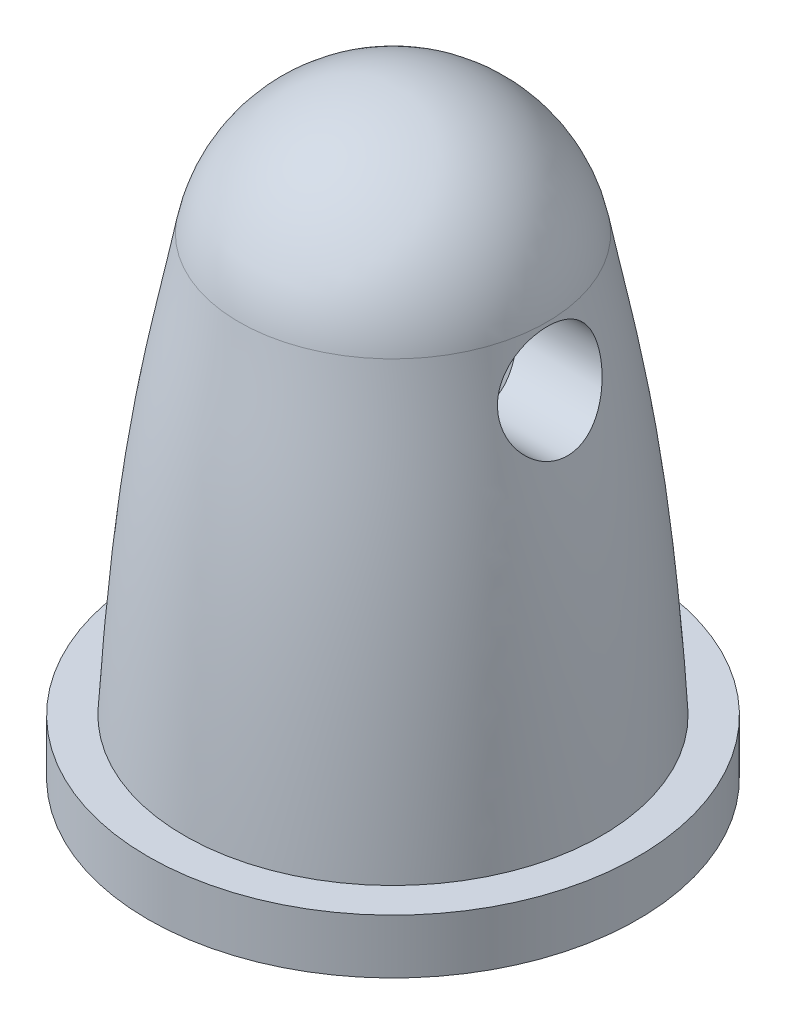
ISO-10303-21;
HEADER;
FILE_DESCRIPTION(('STEP AP214'),'2;1');
FILE_NAME('part.step','',(''),(''),'','','');
FILE_SCHEMA(('AUTOMOTIVE_DESIGN { 1 0 10303 214 1 1 1 1 }'));
ENDSEC;
DATA;
#1=APPLICATION_CONTEXT('core data for automotive mechanical design processes');
#2=APPLICATION_PROTOCOL_DEFINITION('international standard','automotive_design',2000,#1);
#3=PRODUCT_CONTEXT('',#1,'mechanical');
#4=PRODUCT('Part','Part','',(#3));
#5=PRODUCT_RELATED_PRODUCT_CATEGORY('part','',(#4));
#6=PRODUCT_DEFINITION_FORMATION('','',#4);
#7=PRODUCT_DEFINITION_CONTEXT('part definition',#1,'design');
#8=PRODUCT_DEFINITION('design','',#6,#7);
#9=PRODUCT_DEFINITION_SHAPE('','',#8);
#10=(LENGTH_UNIT() NAMED_UNIT(*) SI_UNIT(.MILLI.,.METRE.));
#11=(NAMED_UNIT(*) PLANE_ANGLE_UNIT() SI_UNIT($,.RADIAN.));
#12=(NAMED_UNIT(*) SI_UNIT($,.STERADIAN.) SOLID_ANGLE_UNIT());
#13=UNCERTAINTY_MEASURE_WITH_UNIT(LENGTH_MEASURE(1.E-05),#10,'distance_accuracy_value','');
#14=(GEOMETRIC_REPRESENTATION_CONTEXT(3) GLOBAL_UNCERTAINTY_ASSIGNED_CONTEXT((#13)) GLOBAL_UNIT_ASSIGNED_CONTEXT((#10,
#11,#12)) REPRESENTATION_CONTEXT('',''));
#15=CARTESIAN_POINT('',(0.,0.,0.));
#16=DIRECTION('',(0.,0.,1.));
#17=DIRECTION('',(1.,0.,0.));
#18=AXIS2_PLACEMENT_3D('',#15,#16,#17);
#19=CARTESIAN_POINT('',(0.,9.5,0.));
#20=DIRECTION('',(0.,-1.,0.));
#21=DIRECTION('',(0.,0.,-1.));
#22=AXIS2_PLACEMENT_3D('',#19,#20,#21);
#23=PLANE('',#22);
#24=DIRECTION('',(1.,0.,0.));
#25=VECTOR('',#24,1.);
#26=CARTESIAN_POINT('',(-6.75,9.5,-1.31638630698049));
#27=LINE('',#26,#25);
#28=CARTESIAN_POINT('',(-2.12535340374119,9.5,-1.31638630698049));
#29=VERTEX_POINT('',#28);
#30=CARTESIAN_POINT('',(2.12535340374119,9.5,-1.31638630698049));
#31=VERTEX_POINT('',#30);
#32=EDGE_CURVE('E11',#29,#31,#27,.T.);
#33=ORIENTED_EDGE('',*,*,#32,.F.);
#34=CARTESIAN_POINT('',(0.,9.5,0.));
#35=DIRECTION('',(0.,-1.,0.));
#36=DIRECTION('',(0.,0.,-1.));
#37=AXIS2_PLACEMENT_3D('',#34,#35,#36);
#38=CIRCLE('',#37,2.5);
#39=EDGE_CURVE('E82',#29,#31,#38,.T.);
#40=ORIENTED_EDGE('',*,*,#39,.T.);
#41=EDGE_LOOP('',(#33,#40));
#42=FACE_BOUND('',#41,.T.);
#43=ADVANCED_FACE('F45',(#42),#23,.T.);
#44=CARTESIAN_POINT('',(0.,10.6797448878994,0.));
#45=DIRECTION('',(0.,1.,0.));
#46=DIRECTION('',(-1.,0.,0.));
#47=AXIS2_PLACEMENT_3D('',#44,#45,#46);
#48=SPHERICAL_SURFACE('',#47,4.32025511210058);
#49=CARTESIAN_POINT('',(0.,11.5,0.));
#50=DIRECTION('',(0.,1.,0.));
#51=DIRECTION('',(-1.,0.,0.));
#52=AXIS2_PLACEMENT_3D('',#49,#50,#51);
#53=CIRCLE('',#52,4.24167252209598);
#54=CARTESIAN_POINT('',(-4.24167252209598,11.5,0.));
#55=VERTEX_POINT('',#54);
#56=EDGE_CURVE('E75',#55,#55,#53,.T.);
#57=ORIENTED_EDGE('',*,*,#56,.T.);
#58=EDGE_LOOP('',(#57));
#59=FACE_BOUND('',#58,.T.);
#60=ADVANCED_FACE('F47',(#59),#48,.T.);
#61=CARTESIAN_POINT('',(-4.24167252209598,11.5,0.));
#62=CARTESIAN_POINT('',(-4.80136333247777,8.49823023483901,0.));
#63=CARTESIAN_POINT('',(-5.38545505576879,6.49991136024788,0.));
#64=CARTESIAN_POINT('',(-5.75,0.,0.));
#65=B_SPLINE_CURVE_WITH_KNOTS('',3,(#61,#62,#63,#64),.UNSPECIFIED.,.F.,.F.,(4,4),(0.,1.),.UNSPECIFIED.);
#66=CARTESIAN_POINT('',(0.,15.,0.));
#67=DIRECTION('',(0.,1.,0.));
#68=AXIS1_PLACEMENT('',#66,#67);
#69=SURFACE_OF_REVOLUTION('',#65,#68);
#70=CARTESIAN_POINT('',(-4.25886427817733,11.408145201747,0.));
#71=CARTESIAN_POINT('',(-4.25886343094572,11.4081440183052,-0.078888091113546));
#72=CARTESIAN_POINT('',(-4.25789815285112,11.4014973248225,-0.157788256426419));
#73=CARTESIAN_POINT('',(-4.25426383047997,11.3751065416737,-0.313340820825009));
#74=CARTESIAN_POINT('',(-4.2515942627025,11.3553584276153,-0.389992521688006));
#75=CARTESIAN_POINT('',(-4.24521156157114,11.3033579587206,-0.53883405823016));
#76=CARTESIAN_POINT('',(-4.2414989911151,11.2711123451035,-0.611026275080978));
#77=CARTESIAN_POINT('',(-4.23402999180389,11.1950158228438,-0.749011774443779));
#78=CARTESIAN_POINT('',(-4.23027356063836,11.1511643002012,-0.814804718156197));
#79=CARTESIAN_POINT('',(-4.22392103216107,11.0527563081014,-0.93854230787793));
#80=CARTESIAN_POINT('',(-4.22133189947932,10.998138308273,-0.996438445311252));
#81=CARTESIAN_POINT('',(-4.21865645536383,10.8799039104991,-1.10223948672139));
#82=CARTESIAN_POINT('',(-4.21856967496478,10.8162892008709,-1.1501462611318));
#83=CARTESIAN_POINT('',(-4.22203068488312,10.6831159349492,-1.23381635021332));
#84=CARTESIAN_POINT('',(-4.22551642586192,10.6136774491246,-1.26977308847379));
#85=CARTESIAN_POINT('',(-4.23677394938012,10.4701198516393,-1.3296258898986));
#86=CARTESIAN_POINT('',(-4.2445447227832,10.3960018456555,-1.3535247901786));
#87=CARTESIAN_POINT('',(-4.26430454981433,10.2475707761797,-1.38824662851638));
#88=CARTESIAN_POINT('',(-4.27616820478513,10.1733224027355,-1.39941996692651));
#89=CARTESIAN_POINT('',(-4.30383906394308,10.0247325936802,-1.4098977182161));
#90=CARTESIAN_POINT('',(-4.31964686397006,9.95039114569827,-1.40920033672144));
#91=CARTESIAN_POINT('',(-4.35491357348206,9.80173395361379,-1.39616112150961));
#92=CARTESIAN_POINT('',(-4.37445121040864,9.72746190367057,-1.3835393949153));
#93=CARTESIAN_POINT('',(-4.41587606749609,9.58247192739896,-1.3469001892255));
#94=CARTESIAN_POINT('',(-4.43776409809327,9.5117552394103,-1.32287876959053));
#95=CARTESIAN_POINT('',(-4.48432344043321,9.37039257992908,-1.26206347950905));
#96=CARTESIAN_POINT('',(-4.50908177032456,9.30011577409774,-1.22447681497062));
#97=CARTESIAN_POINT('',(-4.55846407607436,9.16669874487185,-1.13790206116197));
#98=CARTESIAN_POINT('',(-4.58308765537622,9.10357398092935,-1.08888994856308));
#99=CARTESIAN_POINT('',(-4.63154882247806,8.98378081696766,-0.9783038245003));
#100=CARTESIAN_POINT('',(-4.65531472955389,8.92747518853438,-0.916303123971936));
#101=CARTESIAN_POINT('',(-4.69913551755729,8.82636865421289,-0.782600707035401));
#102=CARTESIAN_POINT('',(-4.71919942625347,8.78153965478301,-0.710923348574198));
#103=CARTESIAN_POINT('',(-4.7531489105451,8.70695952771298,-0.563389416173418));
#104=CARTESIAN_POINT('',(-4.76729117651366,8.6765718255496,-0.487915406687652));
#105=CARTESIAN_POINT('',(-4.78955049601213,8.62914834515324,-0.332052798669344));
#106=CARTESIAN_POINT('',(-4.79767222916391,8.61210219626071,-0.251668069845307));
#107=CARTESIAN_POINT('',(-4.80669991505807,8.5931835094767,-0.0963556808167835));
#108=CARTESIAN_POINT('',(-4.80820598606381,8.59004873998288,-0.0216145898445552));
#109=CARTESIAN_POINT('',(-4.80552767976854,8.59564489200729,0.127308986655985));
#110=CARTESIAN_POINT('',(-4.80134457726857,8.60437315531723,0.201491593581661));
#111=CARTESIAN_POINT('',(-4.78789418460293,8.63271412971894,0.344230690789051));
#112=CARTESIAN_POINT('',(-4.77882983845297,8.65189270939941,0.412893810910246));
#113=CARTESIAN_POINT('',(-4.75639299162758,8.70006011801455,0.54592724088857));
#114=CARTESIAN_POINT('',(-4.74301979191679,8.72905053878558,0.610296852153137));
#115=CARTESIAN_POINT('',(-4.71210703771184,8.7974194962702,0.73623642555089));
#116=CARTESIAN_POINT('',(-4.69440254866772,8.83721869917912,0.797536674171018));
#117=CARTESIAN_POINT('',(-4.65626343539911,8.92536384884396,0.912859426842273));
#118=CARTESIAN_POINT('',(-4.63582323471298,8.97372731980152,0.966866600621305));
#119=CARTESIAN_POINT('',(-4.59146692389878,9.08246883678465,1.07106374917265));
#120=CARTESIAN_POINT('',(-4.56740355529576,9.143536576022,1.1204722038265));
#121=CARTESIAN_POINT('',(-4.51894503769046,9.27280387631594,1.20837173202032));
#122=CARTESIAN_POINT('',(-4.49455040243712,9.34099329486206,1.24687804953228));
#123=CARTESIAN_POINT('',(-4.44545994880295,9.48725990649342,1.31408293702041));
#124=CARTESIAN_POINT('',(-4.42082839068509,9.56568093799604,1.34208501340873));
#125=CARTESIAN_POINT('',(-4.37443482289286,9.72703284384123,1.38394467179998));
#126=CARTESIAN_POINT('',(-4.3526721596135,9.80996268486366,1.39780548039876));
#127=CARTESIAN_POINT('',(-4.31406996475206,9.97534891162703,1.41029133494967));
#128=CARTESIAN_POINT('',(-4.29709710016275,10.0577381266962,1.40938194103589));
#129=CARTESIAN_POINT('',(-4.26810383892541,10.2219268056223,1.39298833671689));
#130=CARTESIAN_POINT('',(-4.25608056014036,10.3037265853628,1.3775126255623));
#131=CARTESIAN_POINT('',(-4.23793118888034,10.4579151035015,1.33383956693536));
#132=CARTESIAN_POINT('',(-4.23143472011712,10.5305524384204,1.30666772392248));
#133=CARTESIAN_POINT('',(-4.22252122515259,10.6705739736958,1.24064202936199));
#134=CARTESIAN_POINT('',(-4.22010395421338,10.7379584889721,1.20178887881758));
#135=CARTESIAN_POINT('',(-4.21851832120336,10.8640405236535,1.11447826588493));
#136=CARTESIAN_POINT('',(-4.21928047309719,10.9228950454862,1.06624795434058));
#137=CARTESIAN_POINT('',(-4.22283002346697,11.032053706852,0.960983412108358));
#138=CARTESIAN_POINT('',(-4.22561781391796,11.0823561891812,0.903947479154507));
#139=CARTESIAN_POINT('',(-4.23217041816304,11.1744655129066,0.780763917332841));
#140=CARTESIAN_POINT('',(-4.23596173658184,11.2159764246743,0.714396362198823));
#141=CARTESIAN_POINT('',(-4.24331738776044,11.2874451043816,0.575709170475818));
#142=CARTESIAN_POINT('',(-4.24688176787961,11.317405289465,0.503390783025853));
#143=CARTESIAN_POINT('',(-4.25265606651954,11.3633155102262,0.359891547476675));
#144=CARTESIAN_POINT('',(-4.25494244979247,11.3800893414867,0.288976280441787));
#145=CARTESIAN_POINT('',(-4.25804691646332,11.4025045087516,0.145377378972957));
#146=CARTESIAN_POINT('',(-4.25886505888449,11.4081462922651,0.0726938157435614));
#147=CARTESIAN_POINT('',(-4.25886427817733,11.408145201747,0.));
#148=B_SPLINE_CURVE_WITH_KNOTS('',3,(#70,#71,#72,#73,#74,#75,#76,#77,#78,#79,#80,#81,#82,#83,
#84,#85,#86,#87,#88,#89,#90,#91,#92,#93,#94,#95,#96,#97,#98,#99,#100,#101,#102,#103,#104,#105,
#106,#107,#108,#109,#110,#111,#112,#113,#114,#115,#116,#117,#118,#119,#120,#121,#122,#123,#124,
#125,#126,#127,#128,#129,#130,#131,#132,#133,#134,#135,#136,#137,#138,#139,#140,#141,#142,#143,
#144,#145,#146,#147),.UNSPECIFIED.,.T.,.F.,(4,2,2,2,2,2,2,2,2,2,2,2,2,2,2,2,2,2,2,2,2,2,2,2,2,2,
2,2,2,2,2,2,2,2,2,2,2,2,4),(0.,0.236403135422363,0.472878920962367,0.709227327308627,
0.94558823995024,1.18334130759919,1.4210498177074,1.65469851605233,1.88829221300473,
2.11528534934249,2.34231279819251,2.57480509006313,2.80737780630243,3.05663847575646,
3.30642804871933,3.56628543584055,3.82550050320521,4.0718829111488,4.31807361032084,
4.54139896764379,4.76467429160116,4.97931212374379,5.19398479462989,5.41864821178372,
5.64377676201735,5.88917542933656,6.13422925267383,6.39346372248577,6.65263902984713,
6.90366137633731,7.15453734539514,7.38685921578238,7.61916714715798,7.84642490912266,
8.07372665874698,8.30776417880335,8.54175269676261,8.75960226831249,8.97744308211617),.UNSPECIFIED.);
#149=CARTESIAN_POINT('',(-4.25886427817733,11.408145201747,0.));
#150=VERTEX_POINT('',#149);
#151=EDGE_CURVE('E98',#150,#150,#148,.T.);
#152=ORIENTED_EDGE('',*,*,#151,.F.);
#153=EDGE_LOOP('',(#152));
#154=FACE_BOUND('',#153,.T.);
#155=CARTESIAN_POINT('',(4.30959021666946,10.,-1.40814520174794));
#156=CARTESIAN_POINT('',(4.29394533595754,10.0747547282883,-1.40814655122251));
#157=CARTESIAN_POINT('',(4.28017061477872,10.1498940415387,-1.40217887601156));
#158=CARTESIAN_POINT('',(4.25686528976545,10.298874391215,-1.37812659926051));
#159=CARTESIAN_POINT('',(4.24733292852597,10.3727159530378,-1.36004702288713));
#160=CARTESIAN_POINT('',(4.23253176315989,10.5169469417864,-1.31202924369884));
#161=CARTESIAN_POINT('',(4.22726603949379,10.5873338401053,-1.28208249611715));
#162=CARTESIAN_POINT('',(4.22051772809078,10.7224725480389,-1.21108794791209));
#163=CARTESIAN_POINT('',(4.21903591465473,10.7872232016921,-1.17003787711802));
#164=CARTESIAN_POINT('',(4.21895501506865,10.9088907096803,-1.07822575742675));
#165=CARTESIAN_POINT('',(4.22034125180192,10.9658458666205,-1.02751435590552));
#166=CARTESIAN_POINT('',(4.22485644952711,11.0708065573518,-0.917617655373518));
#167=CARTESIAN_POINT('',(4.22798564660529,11.1188108775645,-0.858431209213937));
#168=CARTESIAN_POINT('',(4.23494757436766,11.2059810163499,-0.731172444847959));
#169=CARTESIAN_POINT('',(4.2387991283157,11.244826224844,-0.662881329062196));
#170=CARTESIAN_POINT('',(4.2460116977825,11.3106483371718,-0.520774617465761));
#171=CARTESIAN_POINT('',(4.24937269573995,11.3376248161888,-0.446958824021275));
#172=CARTESIAN_POINT('',(4.25477968628808,11.3791850575091,-0.294955261348377));
#173=CARTESIAN_POINT('',(4.25681024412399,11.3936239724998,-0.216727231369361));
#174=CARTESIAN_POINT('',(4.25899904616218,11.4091429827059,-0.0589338498302333));
#175=CARTESIAN_POINT('',(4.25915740587812,11.410223902103,0.0206314189195891));
#176=CARTESIAN_POINT('',(4.25757261603481,11.3990510644295,0.178030010538543));
#177=CARTESIAN_POINT('',(4.25584766680694,11.3869249431792,0.255872623061046));
#178=CARTESIAN_POINT('',(4.25093542321119,11.3499012871602,0.40841182042891));
#179=CARTESIAN_POINT('',(4.24774803049557,11.3250028934568,0.483108193324178));
#180=CARTESIAN_POINT('',(4.24069982882114,11.2630395001671,0.627534989508571));
#181=CARTESIAN_POINT('',(4.23683677759947,11.2259336153345,0.697247753291845));
#182=CARTESIAN_POINT('',(4.22954945866913,11.14059292707,0.829527855945051));
#183=CARTESIAN_POINT('',(4.2261252278036,11.0923571901324,0.892094594790494));
#184=CARTESIAN_POINT('',(4.22096575567688,10.9857242326414,1.00871299024146));
#185=CARTESIAN_POINT('',(4.21924148265117,10.9272638527415,1.06270748841572));
#186=CARTESIAN_POINT('',(4.21879744200447,10.8020863340728,1.16009245083609));
#187=CARTESIAN_POINT('',(4.22007691014986,10.7353712996042,1.20348560925055));
#188=CARTESIAN_POINT('',(4.22659429651548,10.597386177356,1.27749254484313));
#189=CARTESIAN_POINT('',(4.23173852833478,10.5262598929639,1.30838255664621));
#190=CARTESIAN_POINT('',(4.2464077078922,10.3803240271173,1.35800024277714));
#191=CARTESIAN_POINT('',(4.25593195113554,10.3055150397276,1.37672987185109));
#192=CARTESIAN_POINT('',(4.27908758248901,10.1562051543301,1.40145457440324));
#193=CARTESIAN_POINT('',(4.29262344911186,10.081734052483,1.40772220161514));
#194=CARTESIAN_POINT('',(4.32338182802691,9.93350234578669,1.40852698664764));
#195=CARTESIAN_POINT('',(4.34060509531433,9.85974188967905,1.40306174009068));
#196=CARTESIAN_POINT('',(4.37859325292224,9.71201468325025,1.38048035948972));
#197=CARTESIAN_POINT('',(4.39946530712775,9.63814059083785,1.36294209904237));
#198=CARTESIAN_POINT('',(4.44316695306358,9.494526538776,1.31646555388645));
#199=CARTESIAN_POINT('',(4.46600058297534,9.4247956327104,1.28750328895727));
#200=CARTESIAN_POINT('',(4.51404527028311,9.28605802006976,1.21641841870768));
#201=CARTESIAN_POINT('',(4.53930740934933,9.21748466091213,1.17348222771139));
#202=CARTESIAN_POINT('',(4.58893860733346,9.08859697758857,1.07643604590603));
#203=CARTESIAN_POINT('',(4.61330914210194,9.02826850650289,1.02234560464798));
#204=CARTESIAN_POINT('',(4.66015065891979,8.91597331476703,0.902583931917324));
#205=CARTESIAN_POINT('',(4.68256061051977,8.86424716789689,0.836661834599392));
#206=CARTESIAN_POINT('',(4.72304957651572,8.77286039991646,0.695732044444105));
#207=CARTESIAN_POINT('',(4.74113078653783,8.73319365926164,0.620728986848869));
#208=CARTESIAN_POINT('',(4.77037894108641,8.66988425709338,0.469004603790351));
#209=CARTESIAN_POINT('',(4.78192585147228,8.64535110824444,0.392729554409024));
#210=CARTESIAN_POINT('',(4.79887079221998,8.60954730927926,0.23648340997358));
#211=CARTESIAN_POINT('',(4.80427314056833,8.59826734552823,0.15651495157445));
#212=CARTESIAN_POINT('',(4.80825554530345,8.58994462811659,0.00282626159214297));
#213=CARTESIAN_POINT('',(4.80739875856019,8.59172668864278,-0.0708183111921897));
#214=CARTESIAN_POINT('',(4.80025048316134,8.60669378229353,-0.216660000498097));
#215=CARTESIAN_POINT('',(4.79395963798362,8.61987746528713,-0.288857287365353));
#216=CARTESIAN_POINT('',(4.77660746669996,8.65667199861181,-0.428297430573682));
#217=CARTESIAN_POINT('',(4.76564722493998,8.68006214308186,-0.495611766717179));
#218=CARTESIAN_POINT('',(4.73972036847765,8.73633105650029,-0.625310861612371));
#219=CARTESIAN_POINT('',(4.72475288692327,8.76921187860638,-0.687694549972725));
#220=CARTESIAN_POINT('',(4.69071405978572,8.84569371423853,-0.809915192681984));
#221=CARTESIAN_POINT('',(4.67144772142612,8.88982734414837,-0.86936309795218));
#222=CARTESIAN_POINT('',(4.63059473865386,8.98638863375155,-0.980240390608341));
#223=CARTESIAN_POINT('',(4.60900677683537,9.03882101061613,-1.0316651842859));
#224=CARTESIAN_POINT('',(4.57481571597136,9.12523819013465,-1.1041977116761));
#225=CARTESIAN_POINT('',(4.56258825248311,9.15677692657139,-1.12846198685866));
#226=CARTESIAN_POINT('',(4.53801233243494,9.22172393221763,-1.17419564572205));
#227=CARTESIAN_POINT('',(4.52566400245885,9.25513038881428,-1.19566767417972));
#228=CARTESIAN_POINT('',(4.4886895188324,9.35797238538375,-1.25577670555464));
#229=CARTESIAN_POINT('',(4.46413677362455,9.4300233581528,-1.29010063042281));
#230=CARTESIAN_POINT('',(4.41566208179063,9.58294277501937,-1.34756323571145));
#231=CARTESIAN_POINT('',(4.39182595131985,9.66406778552186,-1.37009095225531));
#232=CARTESIAN_POINT('',(4.3477138647596,9.82996346003225,-1.4003760258463));
#233=CARTESIAN_POINT('',(4.32743543986382,9.91473154473319,-1.40814366247924));
#234=CARTESIAN_POINT('',(4.30959021666946,10.,-1.40814520174794));
#235=B_SPLINE_CURVE_WITH_KNOTS('',3,(#155,#156,#157,#158,#159,#160,#161,#162,#163,#164,#165,
#166,#167,#168,#169,#170,#171,#172,#173,#174,#175,#176,#177,#178,#179,#180,#181,#182,#183,#184,
#185,#186,#187,#188,#189,#190,#191,#192,#193,#194,#195,#196,#197,#198,#199,#200,#201,#202,#203,
#204,#205,#206,#207,#208,#209,#210,#211,#212,#213,#214,#215,#216,#217,#218,#219,#220,#221,#222,
#223,#224,#225,#226,#227,#228,#229,#230,#231,#232,#233,#234),.UNSPECIFIED.,.T.,.F.,(4,2,2,2,2,2,
2,2,2,2,2,2,2,2,2,2,2,2,2,2,2,2,2,2,2,2,2,2,2,2,2,2,2,2,2,2,2,2,2,4),(0.,0.228836528065193,
0.457578171760343,0.686484817355405,0.915438300322957,1.14322302274748,1.37103860641503,
1.60592581148882,1.84082142318201,2.07839600920387,2.31595593691922,2.55124023996314,
2.78654036794003,3.02263672360362,3.25875288882738,3.49638271086589,3.73395207995393,
3.96594115599157,4.19789293122236,4.42471335521936,4.65158026518437,4.88681150843719,
5.12253917791318,5.37566603776419,5.62835296778285,5.88721953337158,6.14595451703702,
6.38747634618718,6.62882834490884,6.84875086982495,7.06864735602945,7.28400772919665,
7.49941472713162,7.72799478511977,7.95670524224819,8.08147055853795,8.20611682449206,
8.45543847804852,8.71664123513238,8.9776620120587),.UNSPECIFIED.);
#236=CARTESIAN_POINT('',(4.30959021666946,10.,-1.40814520174794));
#237=VERTEX_POINT('',#236);
#238=EDGE_CURVE('E84',#237,#237,#235,.T.);
#239=ORIENTED_EDGE('',*,*,#238,.F.);
#240=EDGE_LOOP('',(#239));
#241=FACE_BOUND('',#240,.T.);
#242=CARTESIAN_POINT('',(0.,0.,0.));
#243=DIRECTION('',(0.,1.,0.));
#244=DIRECTION('',(-1.,0.,0.));
#245=AXIS2_PLACEMENT_3D('',#242,#243,#244);
#246=CIRCLE('',#245,5.75);
#247=CARTESIAN_POINT('',(-5.75,0.,0.));
#248=VERTEX_POINT('',#247);
#249=EDGE_CURVE('E109',#248,#248,#246,.T.);
#250=ORIENTED_EDGE('',*,*,#249,.T.);
#251=EDGE_LOOP('',(#250));
#252=FACE_BOUND('',#251,.T.);
#253=ORIENTED_EDGE('',*,*,#56,.F.);
#254=EDGE_LOOP('',(#253));
#255=FACE_BOUND('',#254,.T.);
#256=ADVANCED_FACE('F119',(#154,#241,#252,#255),#69,.F.);
#257=CARTESIAN_POINT('',(0.,-1.5,0.));
#258=DIRECTION('',(0.,1.,0.));
#259=DIRECTION('',(0.,0.,1.));
#260=AXIS2_PLACEMENT_3D('',#257,#258,#259);
#261=CYLINDRICAL_SURFACE('',#260,6.75);
#262=CARTESIAN_POINT('',(0.,-1.5,0.));
#263=DIRECTION('',(0.,-1.,0.));
#264=DIRECTION('',(0.,0.,-1.));
#265=AXIS2_PLACEMENT_3D('',#262,#263,#264);
#266=CIRCLE('',#265,6.75);
#267=CARTESIAN_POINT('',(0.,-1.5,-6.75));
#268=VERTEX_POINT('',#267);
#269=EDGE_CURVE('E93',#268,#268,#266,.T.);
#270=ORIENTED_EDGE('',*,*,#269,.F.);
#271=EDGE_LOOP('',(#270));
#272=FACE_BOUND('',#271,.T.);
#273=CARTESIAN_POINT('',(0.,0.,0.));
#274=DIRECTION('',(0.,-1.,0.));
#275=DIRECTION('',(0.,0.,-1.));
#276=AXIS2_PLACEMENT_3D('',#273,#274,#275);
#277=CIRCLE('',#276,6.75);
#278=CARTESIAN_POINT('',(0.,0.,-6.75));
#279=VERTEX_POINT('',#278);
#280=EDGE_CURVE('E88',#279,#279,#277,.T.);
#281=ORIENTED_EDGE('',*,*,#280,.T.);
#282=EDGE_LOOP('',(#281));
#283=FACE_BOUND('',#282,.T.);
#284=ADVANCED_FACE('F123',(#272,#283),#261,.T.);
#285=CARTESIAN_POINT('',(0.,-1.5,0.));
#286=DIRECTION('',(0.,-1.,0.));
#287=DIRECTION('',(0.,0.,-1.));
#288=AXIS2_PLACEMENT_3D('',#285,#286,#287);
#289=PLANE('',#288);
#290=CARTESIAN_POINT('',(0.,-1.5,0.));
#291=DIRECTION('',(0.,-1.,0.));
#292=DIRECTION('',(0.,0.,-1.));
#293=AXIS2_PLACEMENT_3D('',#290,#291,#292);
#294=CIRCLE('',#293,2.5);
#295=CARTESIAN_POINT('',(0.,-1.5,-2.5));
#296=VERTEX_POINT('',#295);
#297=EDGE_CURVE('E95',#296,#296,#294,.T.);
#298=ORIENTED_EDGE('',*,*,#297,.F.);
#299=EDGE_LOOP('',(#298));
#300=FACE_BOUND('',#299,.T.);
#301=ORIENTED_EDGE('',*,*,#269,.T.);
#302=EDGE_LOOP('',(#301));
#303=FACE_BOUND('',#302,.T.);
#304=ADVANCED_FACE('F154',(#300,#303),#289,.T.);
#305=CARTESIAN_POINT('',(0.,0.,0.));
#306=DIRECTION('',(0.,-1.,0.));
#307=DIRECTION('',(0.,0.,-1.));
#308=AXIS2_PLACEMENT_3D('',#305,#306,#307);
#309=PLANE('',#308);
#310=ORIENTED_EDGE('',*,*,#249,.F.);
#311=EDGE_LOOP('',(#310));
#312=FACE_BOUND('',#311,.T.);
#313=ORIENTED_EDGE('',*,*,#280,.F.);
#314=EDGE_LOOP('',(#313));
#315=FACE_BOUND('',#314,.T.);
#316=ADVANCED_FACE('F153',(#312,#315),#309,.F.);
#317=CARTESIAN_POINT('',(0.,9.5,0.));
#318=DIRECTION('',(0.,-1.,0.));
#319=DIRECTION('',(0.,0.,-1.));
#320=AXIS2_PLACEMENT_3D('',#317,#318,#319);
#321=CYLINDRICAL_SURFACE('',#320,2.5);
#322=ORIENTED_EDGE('',*,*,#39,.F.);
#323=CARTESIAN_POINT('',(-2.12535340374119,9.5,-1.31638630698049));
#324=CARTESIAN_POINT('',(-2.14343467257802,9.42324119398876,-1.28720455820582));
#325=CARTESIAN_POINT('',(-2.16461341814112,9.34985435625439,-1.25167655363524));
#326=CARTESIAN_POINT('',(-2.21027513431036,9.2109995585131,-1.16913945975044));
#327=CARTESIAN_POINT('',(-2.23475673804233,9.14552834379951,-1.12213511339109));
#328=CARTESIAN_POINT('',(-2.28410307007731,9.02373802259465,-1.01793638731284));
#329=CARTESIAN_POINT('',(-2.3089669215283,8.96740063985899,-0.960762848822927));
#330=CARTESIAN_POINT('',(-2.35660919967841,8.86486040447523,-0.837124648988969));
#331=CARTESIAN_POINT('',(-2.37938711505441,8.81866003284722,-0.770657719602357));
#332=CARTESIAN_POINT('',(-2.42083151855011,8.73724690885494,-0.628592865949672));
#333=CARTESIAN_POINT('',(-2.43942821789806,8.70221708316626,-0.552868516608759));
#334=CARTESIAN_POINT('',(-2.46986064282525,8.64587629428458,-0.395225863814871));
#335=CARTESIAN_POINT('',(-2.48170473286181,8.62454835439119,-0.313315366274572));
#336=CARTESIAN_POINT('',(-2.49621628927092,8.59854829057585,-0.156150545115297));
#337=CARTESIAN_POINT('',(-2.49980416822165,8.59220321902047,-0.0812562726208634));
#338=CARTESIAN_POINT('',(-2.50017980140861,8.59153483790509,0.0685949484622098));
#339=CARTESIAN_POINT('',(-2.49696978927166,8.59720757957509,0.143551868376895));
#340=CARTESIAN_POINT('',(-2.48458982446274,8.61937204574076,0.285508164235501));
#341=CARTESIAN_POINT('',(-2.47588378466432,8.63502250084408,0.352683302043978));
#342=CARTESIAN_POINT('',(-2.45373234616771,8.67562686495875,0.483310001417672));
#343=CARTESIAN_POINT('',(-2.44028677519515,8.70058111214993,0.546761427534129));
#344=CARTESIAN_POINT('',(-2.40889035486465,8.76051905221149,0.672046763317179));
#345=CARTESIAN_POINT('',(-2.39073221925529,8.79597928431716,0.733599289184392));
#346=CARTESIAN_POINT('',(-2.35179827661177,8.87526844490848,0.850195051421396));
#347=CARTESIAN_POINT('',(-2.33101950696092,8.91910687428169,0.905230781865649));
#348=CARTESIAN_POINT('',(-2.2858194765306,9.02013531073051,1.01436420221788));
#349=CARTESIAN_POINT('',(-2.26126600028163,9.07830678650654,1.06749974105491));
#350=CARTESIAN_POINT('',(-2.21340929456927,9.20291147427089,1.1634823319562));
#351=CARTESIAN_POINT('',(-2.19010378668262,9.26932884059384,1.20634866703467));
#352=CARTESIAN_POINT('',(-2.15303868058163,9.39101209332493,1.27099592119699));
#353=CARTESIAN_POINT('',(-2.13837687783461,9.44464904347371,1.29535919392709));
#354=CARTESIAN_POINT('',(-2.12535340374119,9.5,1.31638630698049));
#355=B_SPLINE_CURVE_WITH_KNOTS('',3,(#323,#324,#325,#326,#327,#328,#329,#330,#331,#332,#333,
#334,#335,#336,#337,#338,#339,#340,#341,#342,#343,#344,#345,#346,#347,#348,#349,#350,#351,#352,
#353,#354),.UNSPECIFIED.,.F.,.F.,(4,2,2,2,2,2,2,2,2,2,2,2,2,2,2,4),(0.,0.25161017195686,
0.503116533686961,0.754113263966221,1.00517135700858,1.26015154078853,1.5148151905215,
1.73932916505095,1.96376938102514,2.17141627013214,2.37907070764934,2.59815772419482,
2.81749467593707,3.06402346442695,3.31008563948528,3.49176835585453),.UNSPECIFIED.);
#356=CARTESIAN_POINT('',(-2.12535340374119,9.5,1.31638630698049));
#357=VERTEX_POINT('',#356);
#358=EDGE_CURVE('E65',#29,#357,#355,.T.);
#359=ORIENTED_EDGE('',*,*,#358,.T.);
#360=CARTESIAN_POINT('',(2.12535340374119,9.5,1.31638630698049));
#361=VERTEX_POINT('',#360);
#362=EDGE_CURVE('E80',#361,#357,#38,.T.);
#363=ORIENTED_EDGE('',*,*,#362,.F.);
#364=CARTESIAN_POINT('',(2.12535340374119,9.5,1.31638630698049));
#365=CARTESIAN_POINT('',(2.14343467257802,9.42324119398876,1.28720455820582));
#366=CARTESIAN_POINT('',(2.16461341814112,9.34985435625439,1.25167655363524));
#367=CARTESIAN_POINT('',(2.21027513431036,9.2109995585131,1.16913945975044));
#368=CARTESIAN_POINT('',(2.23475673804233,9.14552834379951,1.12213511339109));
#369=CARTESIAN_POINT('',(2.28410307007731,9.02373802259465,1.01793638731284));
#370=CARTESIAN_POINT('',(2.3089669215283,8.96740063985899,0.960762848822927));
#371=CARTESIAN_POINT('',(2.35660919967841,8.86486040447523,0.837124648988969));
#372=CARTESIAN_POINT('',(2.37938711505441,8.81866003284722,0.770657719602357));
#373=CARTESIAN_POINT('',(2.42083151855011,8.73724690885494,0.628592865949672));
#374=CARTESIAN_POINT('',(2.43942821789806,8.70221708316626,0.552868516608759));
#375=CARTESIAN_POINT('',(2.46986064282525,8.64587629428458,0.395225863814871));
#376=CARTESIAN_POINT('',(2.48170473286181,8.62454835439119,0.313315366274572));
#377=CARTESIAN_POINT('',(2.49621628927092,8.59854829057585,0.156150545115297));
#378=CARTESIAN_POINT('',(2.49980416822165,8.59220321902047,0.0812562726208634));
#379=CARTESIAN_POINT('',(2.50017980140861,8.59153483790509,-0.0685949484622098));
#380=CARTESIAN_POINT('',(2.49696978927166,8.59720757957509,-0.143551868376895));
#381=CARTESIAN_POINT('',(2.48458982446274,8.61937204574076,-0.285508164235501));
#382=CARTESIAN_POINT('',(2.47588378466432,8.63502250084408,-0.352683302043978));
#383=CARTESIAN_POINT('',(2.45373234616771,8.67562686495875,-0.483310001417672));
#384=CARTESIAN_POINT('',(2.44028677519515,8.70058111214993,-0.546761427534129));
#385=CARTESIAN_POINT('',(2.40889035486465,8.76051905221149,-0.672046763317179));
#386=CARTESIAN_POINT('',(2.39073221925529,8.79597928431716,-0.733599289184392));
#387=CARTESIAN_POINT('',(2.35179827661177,8.87526844490848,-0.850195051421396));
#388=CARTESIAN_POINT('',(2.33101950696092,8.91910687428169,-0.905230781865649));
#389=CARTESIAN_POINT('',(2.2858194765306,9.02013531073051,-1.01436420221788));
#390=CARTESIAN_POINT('',(2.26126600028163,9.07830678650654,-1.06749974105491));
#391=CARTESIAN_POINT('',(2.21340929456927,9.20291147427089,-1.1634823319562));
#392=CARTESIAN_POINT('',(2.19010378668262,9.26932884059384,-1.20634866703467));
#393=CARTESIAN_POINT('',(2.15303868058163,9.39101209332493,-1.27099592119699));
#394=CARTESIAN_POINT('',(2.13837687783461,9.44464904347371,-1.29535919392709));
#395=CARTESIAN_POINT('',(2.12535340374119,9.5,-1.31638630698049));
#396=B_SPLINE_CURVE_WITH_KNOTS('',3,(#364,#365,#366,#367,#368,#369,#370,#371,#372,#373,#374,
#375,#376,#377,#378,#379,#380,#381,#382,#383,#384,#385,#386,#387,#388,#389,#390,#391,#392,#393,
#394,#395),.UNSPECIFIED.,.F.,.F.,(4,2,2,2,2,2,2,2,2,2,2,2,2,2,2,4),(0.,0.25161017195686,
0.503116533686961,0.754113263966221,1.00517135700858,1.26015154078853,1.5148151905215,
1.73932916505095,1.96376938102514,2.17141627013214,2.37907070764934,2.59815772419482,
2.81749467593707,3.06402346442695,3.31008563948528,3.49176835585453),.UNSPECIFIED.);
#397=EDGE_CURVE('E60',#361,#31,#396,.T.);
#398=ORIENTED_EDGE('',*,*,#397,.T.);
#399=EDGE_LOOP('',(#322,#359,#363,#398));
#400=FACE_BOUND('',#399,.T.);
#401=ORIENTED_EDGE('',*,*,#297,.T.);
#402=EDGE_LOOP('',(#401));
#403=FACE_BOUND('',#402,.T.);
#404=ADVANCED_FACE('F78',(#400,#403),#321,.F.);
#405=DIRECTION('',(1.,0.,0.));
#406=VECTOR('',#405,1.);
#407=CARTESIAN_POINT('',(-6.75,9.5,1.31638630698049));
#408=LINE('',#407,#406);
#409=EDGE_CURVE('E54',#361,#357,#408,.F.);
#410=ORIENTED_EDGE('',*,*,#409,.F.);
#411=ORIENTED_EDGE('',*,*,#362,.T.);
#412=EDGE_LOOP('',(#410,#411));
#413=FACE_BOUND('',#412,.T.);
#414=ADVANCED_FACE('F86',(#413),#23,.T.);
#415=CARTESIAN_POINT('',(-6.75,10.,0.));
#416=DIRECTION('',(1.,0.,0.));
#417=DIRECTION('',(0.,0.,-1.));
#418=AXIS2_PLACEMENT_3D('',#415,#416,#417);
#419=CYLINDRICAL_SURFACE('',#418,1.40814520174794);
#420=ORIENTED_EDGE('',*,*,#151,.T.);
#421=EDGE_LOOP('',(#420));
#422=FACE_BOUND('',#421,.T.);
#423=ORIENTED_EDGE('',*,*,#238,.T.);
#424=EDGE_LOOP('',(#423));
#425=FACE_BOUND('',#424,.T.);
#426=ORIENTED_EDGE('',*,*,#32,.T.);
#427=ORIENTED_EDGE('',*,*,#397,.F.);
#428=ORIENTED_EDGE('',*,*,#409,.T.);
#429=ORIENTED_EDGE('',*,*,#358,.F.);
#430=EDGE_LOOP('',(#426,#427,#428,#429));
#431=FACE_BOUND('',#430,.T.);
#432=ADVANCED_FACE('F70',(#422,#425,#431),#419,.F.);
#433=CLOSED_SHELL('',(#43,#60,#256,#284,#304,#316,#404,#414,#432));
#434=MANIFOLD_SOLID_BREP('B2',#433);
#435=ADVANCED_BREP_SHAPE_REPRESENTATION('',(#18,#434),#14);
#436=SHAPE_DEFINITION_REPRESENTATION(#9,#435);
ENDSEC;
END-ISO-10303-21;
